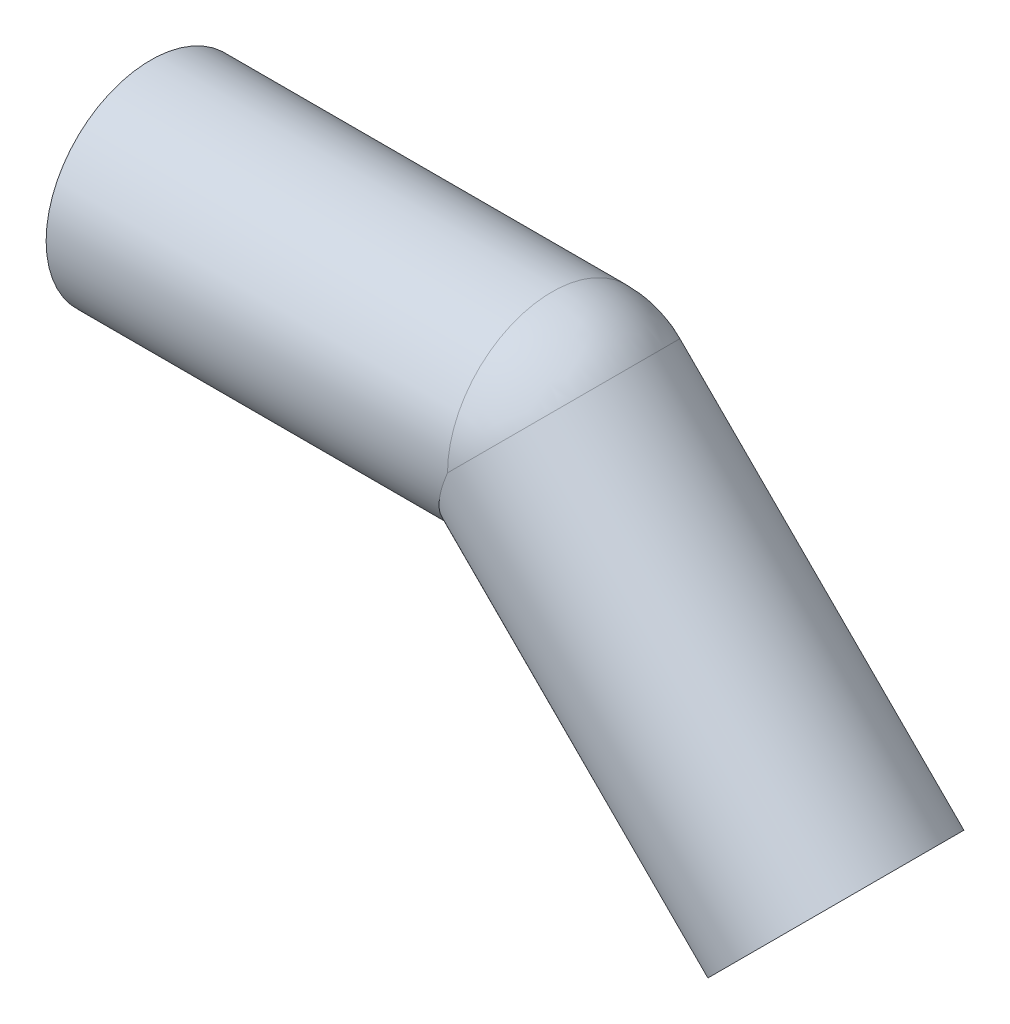
ISO-10303-21;
HEADER;
FILE_DESCRIPTION(('STEP AP214'),'2;1');
FILE_NAME('part.step','',(''),(''),'','','');
FILE_SCHEMA(('AUTOMOTIVE_DESIGN { 1 0 10303 214 1 1 1 1 }'));
ENDSEC;
DATA;
#1=APPLICATION_CONTEXT('core data for automotive mechanical design processes');
#2=APPLICATION_PROTOCOL_DEFINITION('international standard','automotive_design',2000,#1);
#3=PRODUCT_CONTEXT('',#1,'mechanical');
#4=PRODUCT('Part','Part','',(#3));
#5=PRODUCT_RELATED_PRODUCT_CATEGORY('part','',(#4));
#6=PRODUCT_DEFINITION_FORMATION('','',#4);
#7=PRODUCT_DEFINITION_CONTEXT('part definition',#1,'design');
#8=PRODUCT_DEFINITION('design','',#6,#7);
#9=PRODUCT_DEFINITION_SHAPE('','',#8);
#10=(LENGTH_UNIT() NAMED_UNIT(*) SI_UNIT(.MILLI.,.METRE.));
#11=(NAMED_UNIT(*) PLANE_ANGLE_UNIT() SI_UNIT($,.RADIAN.));
#12=(NAMED_UNIT(*) SI_UNIT($,.STERADIAN.) SOLID_ANGLE_UNIT());
#13=UNCERTAINTY_MEASURE_WITH_UNIT(LENGTH_MEASURE(1.E-05),#10,'distance_accuracy_value','');
#14=(GEOMETRIC_REPRESENTATION_CONTEXT(3) GLOBAL_UNCERTAINTY_ASSIGNED_CONTEXT((#13)) GLOBAL_UNIT_ASSIGNED_CONTEXT((#10,
#11,#12)) REPRESENTATION_CONTEXT('',''));
#15=CARTESIAN_POINT('',(0.,0.,0.));
#16=DIRECTION('',(0.,0.,1.));
#17=DIRECTION('',(1.,0.,0.));
#18=AXIS2_PLACEMENT_3D('',#15,#16,#17);
#19=CARTESIAN_POINT('',(81.9411254969544,-33.941125496954,0.));
#20=DIRECTION('',(-0.707106781186557,0.707106781186538,0.));
#21=DIRECTION('',(-0.707106781186538,-0.707106781186557,0.));
#22=AXIS2_PLACEMENT_3D('',#19,#20,#21);
#23=CYLINDRICAL_SURFACE('',#22,10.2);
#24=CARTESIAN_POINT('',(48.,0.,0.));
#25=DIRECTION('',(0.707106781186548,-0.707106781186547,0.));
#26=DIRECTION('',(0.,0.,-1.));
#27=AXIS2_PLACEMENT_3D('',#24,#25,#26);
#28=CIRCLE('',#27,10.2);
#29=CARTESIAN_POINT('',(55.2124891679362,7.21248916826938,0.));
#30=VERTEX_POINT('',#29);
#31=CARTESIAN_POINT('',(47.9999999999996,1.52797488919039E-13,10.2));
#32=VERTEX_POINT('',#31);
#33=EDGE_CURVE('E53',#30,#32,#28,.T.);
#34=ORIENTED_EDGE('',*,*,#33,.F.);
#35=CARTESIAN_POINT('',(48.,0.,0.));
#36=DIRECTION('',(0.70710678123554,-0.707106781137555,0.));
#37=DIRECTION('',(0.,0.,-1.));
#38=AXIS2_PLACEMENT_3D('',#35,#36,#37);
#39=CIRCLE('',#38,10.2);
#40=CARTESIAN_POINT('',(47.9999999999996,1.77310766473123E-13,-10.2));
#41=VERTEX_POINT('',#40);
#42=EDGE_CURVE('E46',#41,#30,#39,.T.);
#43=ORIENTED_EDGE('',*,*,#42,.F.);
#44=CARTESIAN_POINT('',(47.9999999999995,0.,0.));
#45=DIRECTION('',(-0.923879532511289,0.382683432365084,0.));
#46=DIRECTION('',(-0.382683432365084,-0.923879532511289,0.));
#47=AXIS2_PLACEMENT_3D('',#44,#45,#46);
#48=ELLIPSE('',#47,11.0404004429824,10.2);
#49=EDGE_CURVE('E55',#32,#41,#48,.F.);
#50=ORIENTED_EDGE('',*,*,#49,.F.);
#51=EDGE_LOOP('',(#34,#43,#50));
#52=FACE_BOUND('',#51,.T.);
#53=CARTESIAN_POINT('',(81.9411254969546,-33.9411254969542,0.));
#54=DIRECTION('',(-0.707106781186556,0.707106781186539,0.));
#55=DIRECTION('',(-0.707106781186539,-0.707106781186556,0.));
#56=AXIS2_PLACEMENT_3D('',#53,#54,#55);
#57=CIRCLE('',#56,10.2);
#58=CARTESIAN_POINT('',(74.7286363288519,-41.153614665057,0.));
#59=VERTEX_POINT('',#58);
#60=EDGE_CURVE('E18',#59,#59,#57,.T.);
#61=ORIENTED_EDGE('',*,*,#60,.F.);
#62=EDGE_LOOP('',(#61));
#63=FACE_BOUND('',#62,.T.);
#64=ADVANCED_FACE('F15',(#52,#63),#23,.F.);
#65=CARTESIAN_POINT('',(48.,0.,0.));
#66=DIRECTION('',(0.,0.,1.));
#67=DIRECTION('',(-1.,0.,0.));
#68=AXIS2_PLACEMENT_3D('',#65,#66,#67);
#69=SPHERICAL_SURFACE('',#68,10.2);
#70=CARTESIAN_POINT('',(48.,0.,0.));
#71=DIRECTION('',(-1.,0.,0.));
#72=DIRECTION('',(0.,1.,0.));
#73=AXIS2_PLACEMENT_3D('',#70,#71,#72);
#74=CIRCLE('',#73,10.2);
#75=EDGE_CURVE('E51',#41,#32,#74,.F.);
#76=ORIENTED_EDGE('',*,*,#75,.F.);
#77=ORIENTED_EDGE('',*,*,#42,.T.);
#78=ORIENTED_EDGE('',*,*,#33,.T.);
#79=EDGE_LOOP('',(#76,#77,#78));
#80=FACE_BOUND('',#79,.T.);
#81=ADVANCED_FACE('F58',(#80),#69,.F.);
#82=CARTESIAN_POINT('',(90.7799602617877,-25.1022907321209,12.6500021083317));
#83=DIRECTION('',(0.707106781186547,-0.707106781186548,0.));
#84=DIRECTION('',(-0.707106781186548,-0.707106781186547,0.));
#85=AXIS2_PLACEMENT_3D('',#82,#83,#84);
#86=PLANE('',#85);
#87=ORIENTED_EDGE('',*,*,#60,.T.);
#88=EDGE_LOOP('',(#87));
#89=FACE_BOUND('',#88,.T.);
#90=CARTESIAN_POINT('',(81.9411254969548,-33.9411254969541,0.));
#91=DIRECTION('',(-0.707106781186562,0.707106781186534,0.));
#92=DIRECTION('',(-0.707106781186534,-0.707106781186562,0.));
#93=AXIS2_PLACEMENT_3D('',#90,#91,#92);
#94=CIRCLE('',#93,12.5);
#95=CARTESIAN_POINT('',(73.1022907321232,-42.7799602617861,0.));
#96=VERTEX_POINT('',#95);
#97=EDGE_CURVE('E71',#96,#96,#94,.T.);
#98=ORIENTED_EDGE('',*,*,#97,.F.);
#99=EDGE_LOOP('',(#98));
#100=FACE_BOUND('',#99,.T.);
#101=ADVANCED_FACE('F80',(#89,#100),#86,.T.);
#102=CARTESIAN_POINT('',(48.,0.,0.));
#103=DIRECTION('',(-1.,0.,0.));
#104=DIRECTION('',(0.,0.,1.));
#105=AXIS2_PLACEMENT_3D('',#102,#103,#104);
#106=CYLINDRICAL_SURFACE('',#105,10.2);
#107=CARTESIAN_POINT('',(0.,0.,0.));
#108=DIRECTION('',(-1.,0.,0.));
#109=DIRECTION('',(0.,0.,1.));
#110=AXIS2_PLACEMENT_3D('',#107,#108,#109);
#111=CIRCLE('',#110,10.2);
#112=CARTESIAN_POINT('',(0.,0.,10.2));
#113=VERTEX_POINT('',#112);
#114=EDGE_CURVE('E68',#113,#113,#111,.F.);
#115=ORIENTED_EDGE('',*,*,#114,.F.);
#116=EDGE_LOOP('',(#115));
#117=FACE_BOUND('',#116,.T.);
#118=ORIENTED_EDGE('',*,*,#49,.T.);
#119=ORIENTED_EDGE('',*,*,#75,.T.);
#120=EDGE_LOOP('',(#118,#119));
#121=FACE_BOUND('',#120,.T.);
#122=ADVANCED_FACE('F83',(#117,#121),#106,.F.);
#123=CARTESIAN_POINT('',(48.,0.,0.));
#124=DIRECTION('',(0.,0.,1.));
#125=DIRECTION('',(1.,0.,0.));
#126=AXIS2_PLACEMENT_3D('',#123,#124,#125);
#127=SPHERICAL_SURFACE('',#126,12.5);
#128=CARTESIAN_POINT('',(48.,0.,0.));
#129=DIRECTION('',(-1.,0.,0.));
#130=DIRECTION('',(0.,1.,0.));
#131=AXIS2_PLACEMENT_3D('',#128,#129,#130);
#132=CIRCLE('',#131,12.5);
#133=CARTESIAN_POINT('',(47.9999999999994,2.31257810398169E-13,12.5));
#134=VERTEX_POINT('',#133);
#135=CARTESIAN_POINT('',(47.9999999999994,2.29893118228386E-13,-12.5000000000001));
#136=VERTEX_POINT('',#135);
#137=EDGE_CURVE('E67',#134,#136,#132,.T.);
#138=ORIENTED_EDGE('',*,*,#137,.F.);
#139=CARTESIAN_POINT('',(48.,0.,0.));
#140=DIRECTION('',(-0.707106781155654,0.707106781217441,0.));
#141=DIRECTION('',(0.,0.,1.));
#142=AXIS2_PLACEMENT_3D('',#139,#140,#141);
#143=CIRCLE('',#142,12.5);
#144=CARTESIAN_POINT('',(56.8388347650248,8.83883476463884,0.));
#145=VERTEX_POINT('',#144);
#146=EDGE_CURVE('E73',#134,#145,#143,.T.);
#147=ORIENTED_EDGE('',*,*,#146,.T.);
#148=CARTESIAN_POINT('',(47.9999999999997,-3.2612801348364E-13,0.));
#149=DIRECTION('',(-0.707106781186561,0.707106781186534,0.));
#150=DIRECTION('',(0.707106781186534,0.707106781186561,0.));
#151=AXIS2_PLACEMENT_3D('',#148,#149,#150);
#152=CIRCLE('',#151,12.5000000000005);
#153=EDGE_CURVE('E33',#136,#145,#152,.F.);
#154=ORIENTED_EDGE('',*,*,#153,.F.);
#155=EDGE_LOOP('',(#138,#147,#154));
#156=FACE_BOUND('',#155,.T.);
#157=ADVANCED_FACE('F87',(#156),#127,.T.);
#158=CARTESIAN_POINT('',(47.9999999999997,-3.27862736959617E-13,0.));
#159=DIRECTION('',(-0.707106781186562,0.707106781186534,0.));
#160=DIRECTION('',(-0.707106781186534,-0.707106781186562,0.));
#161=AXIS2_PLACEMENT_3D('',#158,#159,#160);
#162=CYLINDRICAL_SURFACE('',#161,12.5);
#163=ORIENTED_EDGE('',*,*,#97,.T.);
#164=EDGE_LOOP('',(#163));
#165=FACE_BOUND('',#164,.T.);
#166=CARTESIAN_POINT('',(47.9999999999993,0.,0.));
#167=DIRECTION('',(-0.923879532511291,0.382683432365081,0.));
#168=DIRECTION('',(0.382683432365081,0.923879532511291,0.));
#169=AXIS2_PLACEMENT_3D('',#166,#167,#168);
#170=ELLIPSE('',#169,13.5299025036549,12.5);
#171=EDGE_CURVE('E24',#136,#134,#170,.T.);
#172=ORIENTED_EDGE('',*,*,#171,.F.);
#173=ORIENTED_EDGE('',*,*,#153,.T.);
#174=ORIENTED_EDGE('',*,*,#146,.F.);
#175=EDGE_LOOP('',(#172,#173,#174));
#176=FACE_BOUND('',#175,.T.);
#177=ADVANCED_FACE('F91',(#165,#176),#162,.T.);
#178=CARTESIAN_POINT('',(0.,-12.5,12.6500021083521));
#179=DIRECTION('',(-1.,0.,0.));
#180=DIRECTION('',(0.,1.,0.));
#181=AXIS2_PLACEMENT_3D('',#178,#179,#180);
#182=PLANE('',#181);
#183=ORIENTED_EDGE('',*,*,#114,.T.);
#184=EDGE_LOOP('',(#183));
#185=FACE_BOUND('',#184,.T.);
#186=CARTESIAN_POINT('',(0.,0.,0.));
#187=DIRECTION('',(-1.,0.,0.));
#188=DIRECTION('',(0.,0.,1.));
#189=AXIS2_PLACEMENT_3D('',#186,#187,#188);
#190=CIRCLE('',#189,12.5);
#191=CARTESIAN_POINT('',(0.,0.,12.5));
#192=VERTEX_POINT('',#191);
#193=EDGE_CURVE('E9',#192,#192,#190,.F.);
#194=ORIENTED_EDGE('',*,*,#193,.F.);
#195=EDGE_LOOP('',(#194));
#196=FACE_BOUND('',#195,.T.);
#197=ADVANCED_FACE('F105',(#185,#196),#182,.T.);
#198=CARTESIAN_POINT('',(0.,0.,0.));
#199=DIRECTION('',(-1.,0.,0.));
#200=DIRECTION('',(0.,0.,1.));
#201=AXIS2_PLACEMENT_3D('',#198,#199,#200);
#202=CYLINDRICAL_SURFACE('',#201,12.5);
#203=ORIENTED_EDGE('',*,*,#171,.T.);
#204=ORIENTED_EDGE('',*,*,#137,.T.);
#205=EDGE_LOOP('',(#203,#204));
#206=FACE_BOUND('',#205,.T.);
#207=ORIENTED_EDGE('',*,*,#193,.T.);
#208=EDGE_LOOP('',(#207));
#209=FACE_BOUND('',#208,.T.);
#210=ADVANCED_FACE('F102',(#206,#209),#202,.T.);
#211=CLOSED_SHELL('',(#64,#81,#101,#122,#157,#177,#197,#210));
#212=MANIFOLD_SOLID_BREP('B1',#211);
#213=ADVANCED_BREP_SHAPE_REPRESENTATION('',(#18,#212),#14);
#214=SHAPE_DEFINITION_REPRESENTATION(#9,#213);
ENDSEC;
END-ISO-10303-21;
